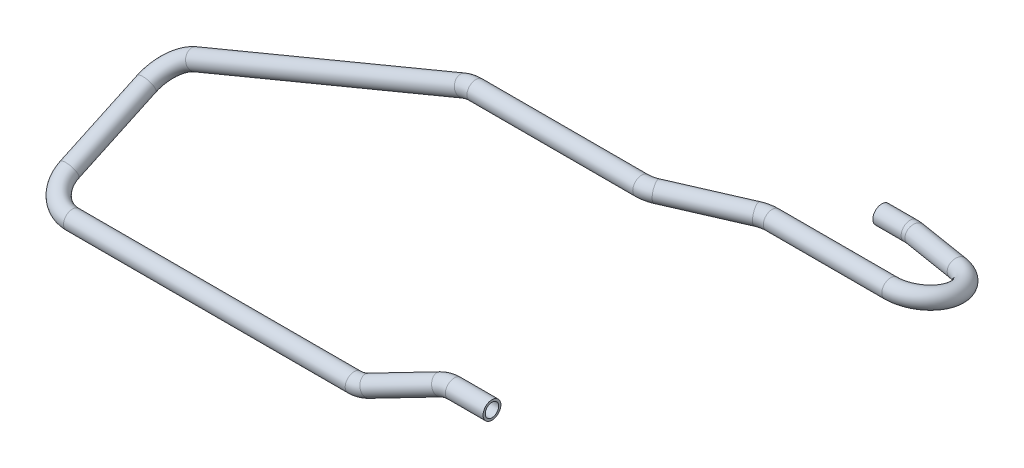
ISO-10303-21;
HEADER;
FILE_DESCRIPTION(('STEP AP214'),'2;1');
FILE_NAME('part.step','',(''),(''),'','','');
FILE_SCHEMA(('AUTOMOTIVE_DESIGN { 1 0 10303 214 1 1 1 1 }'));
ENDSEC;
DATA;
#1=APPLICATION_CONTEXT('core data for automotive mechanical design processes');
#2=APPLICATION_PROTOCOL_DEFINITION('international standard','automotive_design',2000,#1);
#3=PRODUCT_CONTEXT('',#1,'mechanical');
#4=PRODUCT('Part','Part','',(#3));
#5=PRODUCT_RELATED_PRODUCT_CATEGORY('part','',(#4));
#6=PRODUCT_DEFINITION_FORMATION('','',#4);
#7=PRODUCT_DEFINITION_CONTEXT('part definition',#1,'design');
#8=PRODUCT_DEFINITION('design','',#6,#7);
#9=PRODUCT_DEFINITION_SHAPE('','',#8);
#10=(LENGTH_UNIT() NAMED_UNIT(*) SI_UNIT(.MILLI.,.METRE.));
#11=(NAMED_UNIT(*) PLANE_ANGLE_UNIT() SI_UNIT($,.RADIAN.));
#12=(NAMED_UNIT(*) SI_UNIT($,.STERADIAN.) SOLID_ANGLE_UNIT());
#13=UNCERTAINTY_MEASURE_WITH_UNIT(LENGTH_MEASURE(1.E-05),#10,'distance_accuracy_value','');
#14=(GEOMETRIC_REPRESENTATION_CONTEXT(3) GLOBAL_UNCERTAINTY_ASSIGNED_CONTEXT((#13)) GLOBAL_UNIT_ASSIGNED_CONTEXT((#10,
#11,#12)) REPRESENTATION_CONTEXT('',''));
#15=CARTESIAN_POINT('',(0.,0.,0.));
#16=DIRECTION('',(0.,0.,1.));
#17=DIRECTION('',(1.,0.,0.));
#18=AXIS2_PLACEMENT_3D('',#15,#16,#17);
#19=CARTESIAN_POINT('',(130.018143321852,93.9997798299999,-151.));
#20=DIRECTION('',(-1.,0.,0.));
#21=DIRECTION('',(0.,0.,1.));
#22=AXIS2_PLACEMENT_3D('',#19,#20,#21);
#23=CYLINDRICAL_SURFACE('',#22,6.);
#24=CARTESIAN_POINT('',(130.018143321852,93.9997798299999,-151.));
#25=DIRECTION('',(-1.,0.,0.));
#26=DIRECTION('',(0.,0.999290144817172,0.0376723568585314));
#27=AXIS2_PLACEMENT_3D('',#24,#25,#26);
#28=CIRCLE('',#27,6.);
#29=CARTESIAN_POINT('',(130.018143321852,93.0133859061678,-156.918363542993));
#30=VERTEX_POINT('',#29);
#31=EDGE_CURVE('E47',#30,#30,#28,.T.);
#32=ORIENTED_EDGE('',*,*,#31,.T.);
#33=EDGE_LOOP('',(#32));
#34=FACE_BOUND('',#33,.T.);
#35=CARTESIAN_POINT('',(111.,93.9997798299999,-151.));
#36=DIRECTION('',(-1.,0.,0.));
#37=DIRECTION('',(0.,0.999290144817172,0.0376723568585314));
#38=AXIS2_PLACEMENT_3D('',#35,#36,#37);
#39=CIRCLE('',#38,6.);
#40=CARTESIAN_POINT('',(111.,99.995520698903,-150.773965858849));
#41=VERTEX_POINT('',#40);
#42=EDGE_CURVE('E10',#41,#41,#39,.T.);
#43=ORIENTED_EDGE('',*,*,#42,.F.);
#44=EDGE_LOOP('',(#43));
#45=FACE_BOUND('',#44,.T.);
#46=ADVANCED_FACE('F37',(#34,#45),#23,.T.);
#47=CARTESIAN_POINT('',(130.018143321852,93.9997798299999,-151.));
#48=DIRECTION('',(-1.,0.,0.));
#49=DIRECTION('',(0.,0.,1.));
#50=AXIS2_PLACEMENT_3D('',#47,#48,#49);
#51=CYLINDRICAL_SURFACE('',#50,4.5);
#52=CARTESIAN_POINT('',(130.018143321852,93.9997798299999,-151.));
#53=DIRECTION('',(-1.,0.,0.));
#54=DIRECTION('',(0.,0.999290144817172,0.0376723568585314));
#55=AXIS2_PLACEMENT_3D('',#52,#53,#54);
#56=CIRCLE('',#55,4.5);
#57=CARTESIAN_POINT('',(130.018143321852,93.2599843871258,-155.438772657245));
#58=VERTEX_POINT('',#57);
#59=EDGE_CURVE('E51',#58,#58,#56,.T.);
#60=ORIENTED_EDGE('',*,*,#59,.F.);
#61=EDGE_LOOP('',(#60));
#62=FACE_BOUND('',#61,.T.);
#63=CARTESIAN_POINT('',(111.,93.9997798299999,-151.));
#64=DIRECTION('',(-1.,0.,0.));
#65=DIRECTION('',(0.,0.999290144817172,0.0376723568585314));
#66=AXIS2_PLACEMENT_3D('',#63,#64,#65);
#67=CIRCLE('',#66,4.5);
#68=CARTESIAN_POINT('',(111.,98.4965854816772,-150.830474394137));
#69=VERTEX_POINT('',#68);
#70=EDGE_CURVE('E43',#69,#69,#67,.T.);
#71=ORIENTED_EDGE('',*,*,#70,.T.);
#72=EDGE_LOOP('',(#71));
#73=FACE_BOUND('',#72,.T.);
#74=ADVANCED_FACE('F287',(#62,#73),#51,.F.);
#75=CARTESIAN_POINT('',(130.018143321852,97.4521585634124,-130.285727599525));
#76=DIRECTION('',(0.,0.986393923832144,-0.164398987305357));
#77=DIRECTION('',(0.,0.164398987305357,0.986393923832144));
#78=AXIS2_PLACEMENT_3D('',#75,#76,#77);
#79=TOROIDAL_SURFACE('',#78,21.0000000000001,6.);
#80=CARTESIAN_POINT('',(133.946865607606,94.0607339994554,-150.634274983267));
#81=DIRECTION('',(-0.982344298189091,-0.0307560935800937,-0.184536561480577));
#82=DIRECTION('',(-0.037686188405205,0.998705443189747,0.0341641470939823));
#83=AXIS2_PLACEMENT_3D('',#80,#81,#82);
#84=CIRCLE('',#83,6.);
#85=CARTESIAN_POINT('',(135.06935768925,93.0917555526105,-156.448145664337));
#86=VERTEX_POINT('',#85);
#87=EDGE_CURVE('E56',#86,#86,#84,.T.);
#88=CARTESIAN_POINT('',(130.018143321852,97.4521585634124,-130.285727599525));
#89=DIRECTION('',(0.,0.986393923832144,-0.164398987305357));
#90=DIRECTION('',(0.,0.164398987305357,0.986393923832144));
#91=AXIS2_PLACEMENT_3D('',#88,#89,#90);
#92=CIRCLE('',#91,27.0000000000001);
#93=EDGE_CURVE('',#86,#30,#92,.T.);
#94=ORIENTED_EDGE('',*,*,#87,.T.);
#95=ORIENTED_EDGE('',*,*,#31,.F.);
#96=ORIENTED_EDGE('',*,*,#93,.T.);
#97=ORIENTED_EDGE('',*,*,#93,.F.);
#98=EDGE_LOOP('',(#94,#96,#95,#97));
#99=FACE_BOUND('',#98,.T.);
#100=ADVANCED_FACE('F283',(#99),#79,.T.);
#101=CARTESIAN_POINT('',(130.018143321852,97.4521585634124,-130.285727599525));
#102=DIRECTION('',(0.,0.986393923832144,-0.164398987305357));
#103=DIRECTION('',(0.,0.164398987305357,0.986393923832144));
#104=AXIS2_PLACEMENT_3D('',#101,#102,#103);
#105=TOROIDAL_SURFACE('',#104,21.0000000000001,4.5);
#106=CARTESIAN_POINT('',(133.946865607606,94.0607339994554,-150.634274983267));
#107=DIRECTION('',(-0.982344298189091,-0.0307560935800937,-0.184536561480577));
#108=DIRECTION('',(-0.037686188405205,0.998705443189747,0.0341641470939823));
#109=AXIS2_PLACEMENT_3D('',#106,#107,#108);
#110=CIRCLE('',#109,4.5);
#111=CARTESIAN_POINT('',(134.788734668839,93.3340001643217,-154.994677994069));
#112=VERTEX_POINT('',#111);
#113=EDGE_CURVE('E59',#112,#112,#110,.T.);
#114=CARTESIAN_POINT('',(130.018143321852,97.4521585634124,-130.285727599525));
#115=DIRECTION('',(0.,0.986393923832144,-0.164398987305357));
#116=DIRECTION('',(0.,0.164398987305357,0.986393923832144));
#117=AXIS2_PLACEMENT_3D('',#114,#115,#116);
#118=CIRCLE('',#117,25.5000000000001);
#119=EDGE_CURVE('',#112,#58,#118,.T.);
#120=ORIENTED_EDGE('',*,*,#113,.F.);
#121=ORIENTED_EDGE('',*,*,#59,.T.);
#122=ORIENTED_EDGE('',*,*,#119,.T.);
#123=ORIENTED_EDGE('',*,*,#119,.F.);
#124=EDGE_LOOP('',(#120,#122,#121,#123));
#125=FACE_BOUND('',#124,.T.);
#126=ADVANCED_FACE('F280',(#125),#105,.F.);
#127=CARTESIAN_POINT('',(168.928722285755,95.1559765326304,-144.062819784217));
#128=DIRECTION('',(-0.982344298189091,-0.0307560935800954,-0.184536561480576));
#129=DIRECTION('',(-0.184623903458137,0.,0.982809246126572));
#130=AXIS2_PLACEMENT_3D('',#127,#128,#129);
#131=CYLINDRICAL_SURFACE('',#130,6.);
#132=CARTESIAN_POINT('',(168.928722285755,95.1559765326304,-144.062819784217));
#133=DIRECTION('',(-0.982344298189091,-0.0307560935800937,-0.184536561480577));
#134=DIRECTION('',(-0.037686188405205,0.998705443189747,0.0341641470939823));
#135=AXIS2_PLACEMENT_3D('',#132,#133,#134);
#136=CIRCLE('',#135,6.);
#137=CARTESIAN_POINT('',(170.051214367399,94.1869980857855,-149.876690465287));
#138=VERTEX_POINT('',#137);
#139=EDGE_CURVE('E62',#138,#138,#136,.T.);
#140=ORIENTED_EDGE('',*,*,#139,.T.);
#141=EDGE_LOOP('',(#140));
#142=FACE_BOUND('',#141,.T.);
#143=ORIENTED_EDGE('',*,*,#87,.F.);
#144=EDGE_LOOP('',(#143));
#145=FACE_BOUND('',#144,.T.);
#146=ADVANCED_FACE('F276',(#142,#145),#131,.T.);
#147=CARTESIAN_POINT('',(168.928722285755,95.1559765326304,-144.062819784217));
#148=DIRECTION('',(-0.982344298189091,-0.0307560935800954,-0.184536561480576));
#149=DIRECTION('',(-0.184623903458137,0.,0.982809246126572));
#150=AXIS2_PLACEMENT_3D('',#147,#148,#149);
#151=CYLINDRICAL_SURFACE('',#150,4.5);
#152=CARTESIAN_POINT('',(168.928722285755,95.1559765326304,-144.062819784217));
#153=DIRECTION('',(-0.982344298189091,-0.0307560935800937,-0.184536561480577));
#154=DIRECTION('',(-0.037686188405205,0.998705443189747,0.0341641470939823));
#155=AXIS2_PLACEMENT_3D('',#152,#153,#154);
#156=CIRCLE('',#155,4.5);
#157=CARTESIAN_POINT('',(169.770591346988,94.4292426974967,-148.423222795019));
#158=VERTEX_POINT('',#157);
#159=EDGE_CURVE('E65',#158,#158,#156,.T.);
#160=ORIENTED_EDGE('',*,*,#159,.F.);
#161=EDGE_LOOP('',(#160));
#162=FACE_BOUND('',#161,.T.);
#163=ORIENTED_EDGE('',*,*,#113,.T.);
#164=EDGE_LOOP('',(#163));
#165=FACE_BOUND('',#164,.T.);
#166=ADVANCED_FACE('F273',(#162,#165),#151,.F.);
#167=CARTESIAN_POINT('',(165.,98.5474010965874,-123.714272400475));
#168=DIRECTION('',(0.,0.986393923832144,-0.164398987305357));
#169=DIRECTION('',(0.,0.164398987305357,0.986393923832144));
#170=AXIS2_PLACEMENT_3D('',#167,#168,#169);
#171=TOROIDAL_SURFACE('',#170,21.,6.);
#172=CARTESIAN_POINT('',(165.,101.99977983,-103.));
#173=DIRECTION('',(1.,0.,0.));
#174=DIRECTION('',(0.,0.933056399629692,-0.359730114266342));
#175=AXIS2_PLACEMENT_3D('',#172,#173,#174);
#176=CIRCLE('',#175,6.);
#177=CARTESIAN_POINT('',(165.,102.986173753832,-97.0816364570071));
#178=VERTEX_POINT('',#177);
#179=EDGE_CURVE('E68',#178,#178,#176,.T.);
#180=CARTESIAN_POINT('',(165.,98.5474010965874,-123.714272400475));
#181=DIRECTION('',(0.,0.986393923832144,-0.164398987305357));
#182=DIRECTION('',(0.,0.164398987305357,0.986393923832144));
#183=AXIS2_PLACEMENT_3D('',#180,#181,#182);
#184=CIRCLE('',#183,27.);
#185=EDGE_CURVE('',#178,#138,#184,.T.);
#186=ORIENTED_EDGE('',*,*,#179,.T.);
#187=ORIENTED_EDGE('',*,*,#139,.F.);
#188=ORIENTED_EDGE('',*,*,#185,.T.);
#189=ORIENTED_EDGE('',*,*,#185,.F.);
#190=EDGE_LOOP('',(#186,#188,#187,#189));
#191=FACE_BOUND('',#190,.T.);
#192=ADVANCED_FACE('F269',(#191),#171,.T.);
#193=CARTESIAN_POINT('',(165.,98.5474010965874,-123.714272400475));
#194=DIRECTION('',(0.,0.986393923832144,-0.164398987305357));
#195=DIRECTION('',(0.,0.164398987305357,0.986393923832144));
#196=AXIS2_PLACEMENT_3D('',#193,#194,#195);
#197=TOROIDAL_SURFACE('',#196,21.,4.5);
#198=CARTESIAN_POINT('',(165.,101.99977983,-103.));
#199=DIRECTION('',(1.,0.,0.));
#200=DIRECTION('',(0.,0.933056399629692,-0.359730114266342));
#201=AXIS2_PLACEMENT_3D('',#198,#199,#200);
#202=CIRCLE('',#201,4.5);
#203=CARTESIAN_POINT('',(165.,102.739575272874,-98.5612273427553));
#204=VERTEX_POINT('',#203);
#205=EDGE_CURVE('E71',#204,#204,#202,.T.);
#206=CARTESIAN_POINT('',(165.,98.5474010965874,-123.714272400475));
#207=DIRECTION('',(0.,0.986393923832144,-0.164398987305357));
#208=DIRECTION('',(0.,0.164398987305357,0.986393923832144));
#209=AXIS2_PLACEMENT_3D('',#206,#207,#208);
#210=CIRCLE('',#209,25.5);
#211=EDGE_CURVE('',#204,#158,#210,.T.);
#212=ORIENTED_EDGE('',*,*,#205,.F.);
#213=ORIENTED_EDGE('',*,*,#159,.T.);
#214=ORIENTED_EDGE('',*,*,#211,.T.);
#215=ORIENTED_EDGE('',*,*,#211,.F.);
#216=EDGE_LOOP('',(#212,#214,#213,#215));
#217=FACE_BOUND('',#216,.T.);
#218=ADVANCED_FACE('F266',(#217),#197,.F.);
#219=CARTESIAN_POINT('',(85.3822911603711,101.99977983,-103.));
#220=DIRECTION('',(1.,0.,0.));
#221=DIRECTION('',(0.,1.,0.));
#222=AXIS2_PLACEMENT_3D('',#219,#220,#221);
#223=CYLINDRICAL_SURFACE('',#222,6.);
#224=CARTESIAN_POINT('',(85.3822911603711,101.99977983,-103.));
#225=DIRECTION('',(1.,0.,0.));
#226=DIRECTION('',(0.,0.933056399629692,-0.359730114266342));
#227=AXIS2_PLACEMENT_3D('',#224,#225,#226);
#228=CIRCLE('',#227,6.);
#229=CARTESIAN_POINT('',(85.3822911603711,101.99977983,-109.));
#230=VERTEX_POINT('',#229);
#231=EDGE_CURVE('E74',#230,#230,#228,.T.);
#232=ORIENTED_EDGE('',*,*,#231,.T.);
#233=EDGE_LOOP('',(#232));
#234=FACE_BOUND('',#233,.T.);
#235=ORIENTED_EDGE('',*,*,#179,.F.);
#236=EDGE_LOOP('',(#235));
#237=FACE_BOUND('',#236,.T.);
#238=ADVANCED_FACE('F262',(#234,#237),#223,.T.);
#239=CARTESIAN_POINT('',(85.3822911603711,101.99977983,-103.));
#240=DIRECTION('',(1.,0.,0.));
#241=DIRECTION('',(0.,1.,0.));
#242=AXIS2_PLACEMENT_3D('',#239,#240,#241);
#243=CYLINDRICAL_SURFACE('',#242,4.5);
#244=CARTESIAN_POINT('',(85.3822911603711,101.99977983,-103.));
#245=DIRECTION('',(1.,0.,0.));
#246=DIRECTION('',(0.,0.933056399629692,-0.359730114266342));
#247=AXIS2_PLACEMENT_3D('',#244,#245,#246);
#248=CIRCLE('',#247,4.5);
#249=CARTESIAN_POINT('',(85.3822911603711,101.99977983,-107.5));
#250=VERTEX_POINT('',#249);
#251=EDGE_CURVE('E77',#250,#250,#248,.T.);
#252=ORIENTED_EDGE('',*,*,#251,.F.);
#253=EDGE_LOOP('',(#252));
#254=FACE_BOUND('',#253,.T.);
#255=ORIENTED_EDGE('',*,*,#205,.T.);
#256=EDGE_LOOP('',(#255));
#257=FACE_BOUND('',#256,.T.);
#258=ADVANCED_FACE('F259',(#254,#257),#243,.F.);
#259=CARTESIAN_POINT('',(85.3822911603712,101.99977983,-82.));
#260=DIRECTION('',(0.,-1.,0.));
#261=DIRECTION('',(0.,0.,-1.));
#262=AXIS2_PLACEMENT_3D('',#259,#260,#261);
#263=TOROIDAL_SURFACE('',#262,21.,6.);
#264=CARTESIAN_POINT('',(76.9834575840385,101.99977983,-101.247326945762));
#265=DIRECTION('',(0.916539378369634,0.,-0.399944456015839));
#266=DIRECTION('',(-0.14387206486277,0.933056399629692,-0.32970681531051));
#267=AXIS2_PLACEMENT_3D('',#264,#265,#266);
#268=CIRCLE('',#267,6.);
#269=CARTESIAN_POINT('',(74.5837908479435,101.99977983,-106.74656321598));
#270=VERTEX_POINT('',#269);
#271=EDGE_CURVE('E80',#270,#270,#268,.T.);
#272=CARTESIAN_POINT('',(85.3822911603712,101.99977983,-82.));
#273=DIRECTION('',(0.,-1.,0.));
#274=DIRECTION('',(0.,0.,-1.));
#275=AXIS2_PLACEMENT_3D('',#272,#273,#274);
#276=CIRCLE('',#275,27.);
#277=EDGE_CURVE('',#270,#230,#276,.T.);
#278=ORIENTED_EDGE('',*,*,#271,.T.);
#279=ORIENTED_EDGE('',*,*,#231,.F.);
#280=ORIENTED_EDGE('',*,*,#277,.T.);
#281=ORIENTED_EDGE('',*,*,#277,.F.);
#282=EDGE_LOOP('',(#278,#280,#279,#281));
#283=FACE_BOUND('',#282,.T.);
#284=ADVANCED_FACE('F255',(#283),#263,.T.);
#285=CARTESIAN_POINT('',(85.3822911603712,101.99977983,-82.));
#286=DIRECTION('',(0.,-1.,0.));
#287=DIRECTION('',(0.,0.,-1.));
#288=AXIS2_PLACEMENT_3D('',#285,#286,#287);
#289=TOROIDAL_SURFACE('',#288,21.,4.5);
#290=CARTESIAN_POINT('',(76.9834575840385,101.99977983,-101.247326945762));
#291=DIRECTION('',(0.916539378369634,0.,-0.399944456015839));
#292=DIRECTION('',(-0.14387206486277,0.933056399629692,-0.32970681531051));
#293=AXIS2_PLACEMENT_3D('',#290,#291,#292);
#294=CIRCLE('',#293,4.5);
#295=CARTESIAN_POINT('',(75.1837075319672,101.99977983,-105.371754148426));
#296=VERTEX_POINT('',#295);
#297=EDGE_CURVE('E83',#296,#296,#294,.T.);
#298=CARTESIAN_POINT('',(85.3822911603712,101.99977983,-82.));
#299=DIRECTION('',(0.,-1.,0.));
#300=DIRECTION('',(0.,0.,-1.));
#301=AXIS2_PLACEMENT_3D('',#298,#299,#300);
#302=CIRCLE('',#301,25.5);
#303=EDGE_CURVE('',#296,#250,#302,.T.);
#304=ORIENTED_EDGE('',*,*,#297,.F.);
#305=ORIENTED_EDGE('',*,*,#251,.T.);
#306=ORIENTED_EDGE('',*,*,#303,.T.);
#307=ORIENTED_EDGE('',*,*,#303,.F.);
#308=EDGE_LOOP('',(#304,#306,#305,#307));
#309=FACE_BOUND('',#308,.T.);
#310=ADVANCED_FACE('F252',(#309),#289,.F.);
#311=CARTESIAN_POINT('',(30.0165424159614,101.99977983,-80.7526730542376));
#312=DIRECTION('',(0.916539378369633,0.,-0.39994445601584));
#313=DIRECTION('',(-0.39994445601584,0.,-0.916539378369633));
#314=AXIS2_PLACEMENT_3D('',#311,#312,#313);
#315=CYLINDRICAL_SURFACE('',#314,6.);
#316=CARTESIAN_POINT('',(30.0165424159614,101.99977983,-80.7526730542376));
#317=DIRECTION('',(0.916539378369634,0.,-0.399944456015839));
#318=DIRECTION('',(-0.14387206486277,0.933056399629692,-0.32970681531051));
#319=AXIS2_PLACEMENT_3D('',#316,#317,#318);
#320=CIRCLE('',#319,6.);
#321=CARTESIAN_POINT('',(32.4162091520564,101.99977983,-75.2534367840198));
#322=VERTEX_POINT('',#321);
#323=EDGE_CURVE('E86',#322,#322,#320,.T.);
#324=ORIENTED_EDGE('',*,*,#323,.T.);
#325=EDGE_LOOP('',(#324));
#326=FACE_BOUND('',#325,.T.);
#327=ORIENTED_EDGE('',*,*,#271,.F.);
#328=EDGE_LOOP('',(#327));
#329=FACE_BOUND('',#328,.T.);
#330=ADVANCED_FACE('F248',(#326,#329),#315,.T.);
#331=CARTESIAN_POINT('',(30.0165424159614,101.99977983,-80.7526730542376));
#332=DIRECTION('',(0.916539378369633,0.,-0.39994445601584));
#333=DIRECTION('',(-0.39994445601584,0.,-0.916539378369633));
#334=AXIS2_PLACEMENT_3D('',#331,#332,#333);
#335=CYLINDRICAL_SURFACE('',#334,4.5);
#336=CARTESIAN_POINT('',(30.0165424159614,101.99977983,-80.7526730542376));
#337=DIRECTION('',(0.916539378369634,0.,-0.399944456015839));
#338=DIRECTION('',(-0.14387206486277,0.933056399629692,-0.32970681531051));
#339=AXIS2_PLACEMENT_3D('',#336,#337,#338);
#340=CIRCLE('',#339,4.5);
#341=CARTESIAN_POINT('',(31.8162924680326,101.99977983,-76.6282458515743));
#342=VERTEX_POINT('',#341);
#343=EDGE_CURVE('E89',#342,#342,#340,.T.);
#344=ORIENTED_EDGE('',*,*,#343,.F.);
#345=EDGE_LOOP('',(#344));
#346=FACE_BOUND('',#345,.T.);
#347=ORIENTED_EDGE('',*,*,#297,.T.);
#348=EDGE_LOOP('',(#347));
#349=FACE_BOUND('',#348,.T.);
#350=ADVANCED_FACE('F245',(#346,#349),#335,.F.);
#351=CARTESIAN_POINT('',(21.6177088396288,101.99977983,-100.));
#352=DIRECTION('',(0.,1.,0.));
#353=DIRECTION('',(-1.,0.,0.));
#354=AXIS2_PLACEMENT_3D('',#351,#352,#353);
#355=TOROIDAL_SURFACE('',#354,21.,6.);
#356=CARTESIAN_POINT('',(21.6177088396287,101.99977983,-79.));
#357=DIRECTION('',(1.,0.,0.));
#358=DIRECTION('',(0.,0.933056399629692,-0.359730114266342));
#359=AXIS2_PLACEMENT_3D('',#356,#357,#358);
#360=CIRCLE('',#359,6.);
#361=CARTESIAN_POINT('',(21.6177088396287,101.99977983,-73.));
#362=VERTEX_POINT('',#361);
#363=EDGE_CURVE('E92',#362,#362,#360,.T.);
#364=CARTESIAN_POINT('',(21.6177088396288,101.99977983,-100.));
#365=DIRECTION('',(0.,1.,0.));
#366=DIRECTION('',(-1.,0.,0.));
#367=AXIS2_PLACEMENT_3D('',#364,#365,#366);
#368=CIRCLE('',#367,27.);
#369=EDGE_CURVE('',#362,#322,#368,.T.);
#370=ORIENTED_EDGE('',*,*,#363,.T.);
#371=ORIENTED_EDGE('',*,*,#323,.F.);
#372=ORIENTED_EDGE('',*,*,#369,.T.);
#373=ORIENTED_EDGE('',*,*,#369,.F.);
#374=EDGE_LOOP('',(#370,#372,#371,#373));
#375=FACE_BOUND('',#374,.T.);
#376=ADVANCED_FACE('F241',(#375),#355,.T.);
#377=CARTESIAN_POINT('',(21.6177088396288,101.99977983,-100.));
#378=DIRECTION('',(0.,1.,0.));
#379=DIRECTION('',(-1.,0.,0.));
#380=AXIS2_PLACEMENT_3D('',#377,#378,#379);
#381=TOROIDAL_SURFACE('',#380,21.,4.5);
#382=CARTESIAN_POINT('',(21.6177088396287,101.99977983,-79.));
#383=DIRECTION('',(1.,0.,0.));
#384=DIRECTION('',(0.,0.933056399629692,-0.359730114266342));
#385=AXIS2_PLACEMENT_3D('',#382,#383,#384);
#386=CIRCLE('',#385,4.5);
#387=CARTESIAN_POINT('',(21.6177088396287,101.99977983,-74.5));
#388=VERTEX_POINT('',#387);
#389=EDGE_CURVE('E95',#388,#388,#386,.T.);
#390=CARTESIAN_POINT('',(21.6177088396288,101.99977983,-100.));
#391=DIRECTION('',(0.,1.,0.));
#392=DIRECTION('',(-1.,0.,0.));
#393=AXIS2_PLACEMENT_3D('',#390,#391,#392);
#394=CIRCLE('',#393,25.5);
#395=EDGE_CURVE('',#388,#342,#394,.T.);
#396=ORIENTED_EDGE('',*,*,#389,.F.);
#397=ORIENTED_EDGE('',*,*,#343,.T.);
#398=ORIENTED_EDGE('',*,*,#395,.T.);
#399=ORIENTED_EDGE('',*,*,#395,.F.);
#400=EDGE_LOOP('',(#396,#398,#397,#399));
#401=FACE_BOUND('',#400,.T.);
#402=ADVANCED_FACE('F238',(#401),#381,.F.);
#403=CARTESIAN_POINT('',(-89.8147727172371,101.99977983,-79.));
#404=DIRECTION('',(1.,0.,0.));
#405=DIRECTION('',(0.,0.,-1.));
#406=AXIS2_PLACEMENT_3D('',#403,#404,#405);
#407=CYLINDRICAL_SURFACE('',#406,6.);
#408=CARTESIAN_POINT('',(-89.8147727172371,101.99977983,-79.));
#409=DIRECTION('',(1.,0.,0.));
#410=DIRECTION('',(0.,0.933056399629692,-0.359730114266342));
#411=AXIS2_PLACEMENT_3D('',#408,#409,#410);
#412=CIRCLE('',#411,6.);
#413=CARTESIAN_POINT('',(-89.8147727172371,107.99977983,-79.));
#414=VERTEX_POINT('',#413);
#415=EDGE_CURVE('E98',#414,#414,#412,.T.);
#416=ORIENTED_EDGE('',*,*,#415,.T.);
#417=EDGE_LOOP('',(#416));
#418=FACE_BOUND('',#417,.T.);
#419=ORIENTED_EDGE('',*,*,#363,.F.);
#420=EDGE_LOOP('',(#419));
#421=FACE_BOUND('',#420,.T.);
#422=ADVANCED_FACE('F234',(#418,#421),#407,.T.);
#423=CARTESIAN_POINT('',(-89.8147727172371,101.99977983,-79.));
#424=DIRECTION('',(1.,0.,0.));
#425=DIRECTION('',(0.,0.,-1.));
#426=AXIS2_PLACEMENT_3D('',#423,#424,#425);
#427=CYLINDRICAL_SURFACE('',#426,4.5);
#428=CARTESIAN_POINT('',(-89.8147727172371,101.99977983,-79.));
#429=DIRECTION('',(1.,0.,0.));
#430=DIRECTION('',(0.,0.933056399629692,-0.359730114266342));
#431=AXIS2_PLACEMENT_3D('',#428,#429,#430);
#432=CIRCLE('',#431,4.5);
#433=CARTESIAN_POINT('',(-89.8147727172371,106.49977983,-79.));
#434=VERTEX_POINT('',#433);
#435=EDGE_CURVE('E101',#434,#434,#432,.T.);
#436=ORIENTED_EDGE('',*,*,#435,.F.);
#437=EDGE_LOOP('',(#436));
#438=FACE_BOUND('',#437,.T.);
#439=ORIENTED_EDGE('',*,*,#389,.T.);
#440=EDGE_LOOP('',(#439));
#441=FACE_BOUND('',#440,.T.);
#442=ADVANCED_FACE('F231',(#438,#441),#427,.F.);
#443=CARTESIAN_POINT('',(-89.814772717237,80.99977983,-79.));
#444=DIRECTION('',(0.,0.,-1.));
#445=DIRECTION('',(-1.,0.,0.));
#446=AXIS2_PLACEMENT_3D('',#443,#444,#445);
#447=TOROIDAL_SURFACE('',#446,20.9999999999999,6.);
#448=CARTESIAN_POINT('',(-97.8654611068936,100.395305511266,-79.));
#449=DIRECTION('',(0.923596461012666,0.383366113793172,0.));
#450=DIRECTION('',(-0.357702205875883,0.861767588623204,-0.359730114266342));
#451=AXIS2_PLACEMENT_3D('',#448,#449,#450);
#452=CIRCLE('',#451,6.);
#453=CARTESIAN_POINT('',(-100.165657789653,105.936884277342,-79.));
#454=VERTEX_POINT('',#453);
#455=EDGE_CURVE('E104',#454,#454,#452,.T.);
#456=CARTESIAN_POINT('',(-89.814772717237,80.99977983,-79.));
#457=DIRECTION('',(0.,0.,-1.));
#458=DIRECTION('',(-1.,0.,0.));
#459=AXIS2_PLACEMENT_3D('',#456,#457,#458);
#460=CIRCLE('',#459,26.9999999999999);
#461=EDGE_CURVE('',#454,#414,#460,.T.);
#462=ORIENTED_EDGE('',*,*,#455,.T.);
#463=ORIENTED_EDGE('',*,*,#415,.F.);
#464=ORIENTED_EDGE('',*,*,#461,.T.);
#465=ORIENTED_EDGE('',*,*,#461,.F.);
#466=EDGE_LOOP('',(#462,#464,#463,#465));
#467=FACE_BOUND('',#466,.T.);
#468=ADVANCED_FACE('F227',(#467),#447,.T.);
#469=CARTESIAN_POINT('',(-89.814772717237,80.99977983,-79.));
#470=DIRECTION('',(0.,0.,-1.));
#471=DIRECTION('',(-1.,0.,0.));
#472=AXIS2_PLACEMENT_3D('',#469,#470,#471);
#473=TOROIDAL_SURFACE('',#472,20.9999999999999,4.5);
#474=CARTESIAN_POINT('',(-97.8654611068936,100.395305511266,-79.));
#475=DIRECTION('',(0.923596461012666,0.383366113793172,0.));
#476=DIRECTION('',(-0.357702205875883,0.861767588623204,-0.359730114266342));
#477=AXIS2_PLACEMENT_3D('',#474,#475,#476);
#478=CIRCLE('',#477,4.5);
#479=CARTESIAN_POINT('',(-99.5906086189629,104.551489585823,-79.));
#480=VERTEX_POINT('',#479);
#481=EDGE_CURVE('E107',#480,#480,#478,.T.);
#482=CARTESIAN_POINT('',(-89.814772717237,80.99977983,-79.));
#483=DIRECTION('',(0.,0.,-1.));
#484=DIRECTION('',(-1.,0.,0.));
#485=AXIS2_PLACEMENT_3D('',#482,#483,#484);
#486=CIRCLE('',#485,25.4999999999999);
#487=EDGE_CURVE('',#480,#434,#486,.T.);
#488=ORIENTED_EDGE('',*,*,#481,.F.);
#489=ORIENTED_EDGE('',*,*,#435,.T.);
#490=ORIENTED_EDGE('',*,*,#487,.T.);
#491=ORIENTED_EDGE('',*,*,#487,.F.);
#492=EDGE_LOOP('',(#488,#490,#489,#491));
#493=FACE_BOUND('',#492,.T.);
#494=ADVANCED_FACE('F224',(#493),#473,.F.);
#495=CARTESIAN_POINT('',(-278.529276144879,25.4054288737773,-79.));
#496=DIRECTION('',(0.923596461012666,0.383366113793172,0.));
#497=DIRECTION('',(-0.383366113793172,0.923596461012666,0.));
#498=AXIS2_PLACEMENT_3D('',#495,#496,#497);
#499=CYLINDRICAL_SURFACE('',#498,6.);
#500=CARTESIAN_POINT('',(-278.529276144879,25.4054288737773,-79.));
#501=DIRECTION('',(0.923596461012666,0.383366113793172,0.));
#502=DIRECTION('',(-0.357702205875883,0.861767588623204,-0.359730114266342));
#503=AXIS2_PLACEMENT_3D('',#500,#501,#502);
#504=CIRCLE('',#503,6.);
#505=CARTESIAN_POINT('',(-279.439130095125,27.597427222748,-84.5106541378797));
#506=VERTEX_POINT('',#505);
#507=EDGE_CURVE('E110',#506,#506,#504,.T.);
#508=ORIENTED_EDGE('',*,*,#507,.T.);
#509=EDGE_LOOP('',(#508));
#510=FACE_BOUND('',#509,.T.);
#511=ORIENTED_EDGE('',*,*,#455,.F.);
#512=EDGE_LOOP('',(#511));
#513=FACE_BOUND('',#512,.T.);
#514=ADVANCED_FACE('F220',(#510,#513),#499,.T.);
#515=CARTESIAN_POINT('',(-278.529276144879,25.4054288737773,-79.));
#516=DIRECTION('',(0.923596461012666,0.383366113793172,0.));
#517=DIRECTION('',(-0.383366113793172,0.923596461012666,0.));
#518=AXIS2_PLACEMENT_3D('',#515,#516,#517);
#519=CYLINDRICAL_SURFACE('',#518,4.5);
#520=CARTESIAN_POINT('',(-278.529276144879,25.4054288737773,-79.));
#521=DIRECTION('',(0.923596461012666,0.383366113793172,0.));
#522=DIRECTION('',(-0.357702205875883,0.861767588623204,-0.359730114266342));
#523=AXIS2_PLACEMENT_3D('',#520,#521,#522);
#524=CIRCLE('',#523,4.5);
#525=CARTESIAN_POINT('',(-279.211666607564,27.0494276355054,-83.1329906034098));
#526=VERTEX_POINT('',#525);
#527=EDGE_CURVE('E113',#526,#526,#524,.T.);
#528=ORIENTED_EDGE('',*,*,#527,.F.);
#529=EDGE_LOOP('',(#528));
#530=FACE_BOUND('',#529,.T.);
#531=ORIENTED_EDGE('',*,*,#481,.T.);
#532=EDGE_LOOP('',(#531));
#533=FACE_BOUND('',#532,.T.);
#534=ADVANCED_FACE('F217',(#530,#533),#519,.F.);
#535=CARTESIAN_POINT('',(-275.344787319017,17.7334346523799,-59.712710517421));
#536=DIRECTION('',(0.352099676882867,-0.848270109935084,-0.395554848446712));
#537=DIRECTION('',(0.,0.422618261740699,-0.90630778703665));
#538=AXIS2_PLACEMENT_3D('',#535,#536,#537);
#539=TOROIDAL_SURFACE('',#538,21.,6.);
#540=CARTESIAN_POINT('',(-295.,11.0321103939673,-62.8375893388987));
#541=DIRECTION('',(0.,0.4226182617407,-0.906307787036649));
#542=DIRECTION('',(-0.906307787036649,0.38302222155949,0.178606195156731));
#543=AXIS2_PLACEMENT_3D('',#540,#541,#542);
#544=CIRCLE('',#543,6.);
#545=CARTESIAN_POINT('',(-300.615775051709,9.11744632013508,-63.7304118593209));
#546=VERTEX_POINT('',#545);
#547=EDGE_CURVE('E116',#546,#546,#544,.T.);
#548=CARTESIAN_POINT('',(-275.344787319017,17.7334346523799,-59.712710517421));
#549=DIRECTION('',(0.352099676882867,-0.848270109935084,-0.395554848446712));
#550=DIRECTION('',(0.,0.422618261740699,-0.90630778703665));
#551=AXIS2_PLACEMENT_3D('',#548,#549,#550);
#552=CIRCLE('',#551,27.);
#553=EDGE_CURVE('',#546,#506,#552,.T.);
#554=ORIENTED_EDGE('',*,*,#547,.T.);
#555=ORIENTED_EDGE('',*,*,#507,.F.);
#556=ORIENTED_EDGE('',*,*,#553,.T.);
#557=ORIENTED_EDGE('',*,*,#553,.F.);
#558=EDGE_LOOP('',(#554,#556,#555,#557));
#559=FACE_BOUND('',#558,.T.);
#560=ADVANCED_FACE('F213',(#559),#539,.T.);
#561=CARTESIAN_POINT('',(-275.344787319017,17.7334346523799,-59.712710517421));
#562=DIRECTION('',(0.352099676882867,-0.848270109935084,-0.395554848446712));
#563=DIRECTION('',(0.,0.422618261740699,-0.90630778703665));
#564=AXIS2_PLACEMENT_3D('',#561,#562,#563);
#565=TOROIDAL_SURFACE('',#564,21.,4.5);
#566=CARTESIAN_POINT('',(-295.,11.0321103939673,-62.8375893388987));
#567=DIRECTION('',(0.,0.4226182617407,-0.906307787036649));
#568=DIRECTION('',(-0.906307787036649,0.38302222155949,0.178606195156731));
#569=AXIS2_PLACEMENT_3D('',#566,#567,#568);
#570=CIRCLE('',#569,4.5);
#571=CARTESIAN_POINT('',(-299.211831288782,9.59611233859312,-63.5072062292153));
#572=VERTEX_POINT('',#571);
#573=EDGE_CURVE('E119',#572,#572,#570,.T.);
#574=CARTESIAN_POINT('',(-275.344787319017,17.7334346523799,-59.712710517421));
#575=DIRECTION('',(0.352099676882867,-0.848270109935084,-0.395554848446712));
#576=DIRECTION('',(0.,0.422618261740699,-0.90630778703665));
#577=AXIS2_PLACEMENT_3D('',#574,#575,#576);
#578=CIRCLE('',#577,25.5);
#579=EDGE_CURVE('',#572,#526,#578,.T.);
#580=ORIENTED_EDGE('',*,*,#573,.F.);
#581=ORIENTED_EDGE('',*,*,#527,.T.);
#582=ORIENTED_EDGE('',*,*,#579,.T.);
#583=ORIENTED_EDGE('',*,*,#579,.F.);
#584=EDGE_LOOP('',(#580,#582,#581,#583));
#585=FACE_BOUND('',#584,.T.);
#586=ADVANCED_FACE('F210',(#585),#565,.F.);
#587=CARTESIAN_POINT('',(-295.,-13.1250165034453,-11.0324635277696));
#588=DIRECTION('',(0.,0.422618261740698,-0.90630778703665));
#589=DIRECTION('',(0.,0.90630778703665,0.422618261740698));
#590=AXIS2_PLACEMENT_3D('',#587,#588,#589);
#591=CYLINDRICAL_SURFACE('',#590,6.);
#592=CARTESIAN_POINT('',(-295.,-13.1250165034453,-11.0324635277696));
#593=DIRECTION('',(0.,0.4226182617407,-0.906307787036649));
#594=DIRECTION('',(-0.906307787036649,0.38302222155949,0.178606195156731));
#595=AXIS2_PLACEMENT_3D('',#592,#593,#594);
#596=CIRCLE('',#595,6.);
#597=CARTESIAN_POINT('',(-301.,-13.1250165034453,-11.0324635277696));
#598=VERTEX_POINT('',#597);
#599=EDGE_CURVE('E122',#598,#598,#596,.T.);
#600=ORIENTED_EDGE('',*,*,#599,.T.);
#601=EDGE_LOOP('',(#600));
#602=FACE_BOUND('',#601,.T.);
#603=ORIENTED_EDGE('',*,*,#547,.F.);
#604=EDGE_LOOP('',(#603));
#605=FACE_BOUND('',#604,.T.);
#606=ADVANCED_FACE('F206',(#602,#605),#591,.T.);
#607=CARTESIAN_POINT('',(-295.,-13.1250165034453,-11.0324635277696));
#608=DIRECTION('',(0.,0.422618261740698,-0.90630778703665));
#609=DIRECTION('',(0.,0.90630778703665,0.422618261740698));
#610=AXIS2_PLACEMENT_3D('',#607,#608,#609);
#611=CYLINDRICAL_SURFACE('',#610,4.5);
#612=CARTESIAN_POINT('',(-295.,-13.1250165034453,-11.0324635277696));
#613=DIRECTION('',(0.,0.4226182617407,-0.906307787036649));
#614=DIRECTION('',(-0.906307787036649,0.38302222155949,0.178606195156731));
#615=AXIS2_PLACEMENT_3D('',#612,#613,#614);
#616=CIRCLE('',#615,4.5);
#617=CARTESIAN_POINT('',(-299.5,-13.1250165034453,-11.0324635277696));
#618=VERTEX_POINT('',#617);
#619=EDGE_CURVE('E125',#618,#618,#616,.T.);
#620=ORIENTED_EDGE('',*,*,#619,.F.);
#621=EDGE_LOOP('',(#620));
#622=FACE_BOUND('',#621,.T.);
#623=ORIENTED_EDGE('',*,*,#573,.T.);
#624=EDGE_LOOP('',(#623));
#625=FACE_BOUND('',#624,.T.);
#626=ADVANCED_FACE('F203',(#622,#625),#611,.F.);
#627=CARTESIAN_POINT('',(-274.,-13.1250165034453,-11.0324635277697));
#628=DIRECTION('',(0.,-0.90630778703665,-0.4226182617407));
#629=DIRECTION('',(0.,0.4226182617407,-0.90630778703665));
#630=AXIS2_PLACEMENT_3D('',#627,#628,#629);
#631=TOROIDAL_SURFACE('',#630,21.,6.);
#632=CARTESIAN_POINT('',(-274.,-22.,7.99999999999999));
#633=DIRECTION('',(-1.,0.,0.));
#634=DIRECTION('',(0.,0.,1.));
#635=AXIS2_PLACEMENT_3D('',#632,#633,#634);
#636=CIRCLE('',#635,6.);
#637=CARTESIAN_POINT('',(-274.,-24.5357095704442,13.4378467222199));
#638=VERTEX_POINT('',#637);
#639=EDGE_CURVE('E128',#638,#638,#636,.T.);
#640=CARTESIAN_POINT('',(-274.,-13.1250165034453,-11.0324635277697));
#641=DIRECTION('',(0.,-0.90630778703665,-0.4226182617407));
#642=DIRECTION('',(0.,0.4226182617407,-0.90630778703665));
#643=AXIS2_PLACEMENT_3D('',#640,#641,#642);
#644=CIRCLE('',#643,27.);
#645=EDGE_CURVE('',#638,#598,#644,.T.);
#646=ORIENTED_EDGE('',*,*,#639,.T.);
#647=ORIENTED_EDGE('',*,*,#599,.F.);
#648=ORIENTED_EDGE('',*,*,#645,.T.);
#649=ORIENTED_EDGE('',*,*,#645,.F.);
#650=EDGE_LOOP('',(#646,#648,#647,#649));
#651=FACE_BOUND('',#650,.T.);
#652=ADVANCED_FACE('F199',(#651),#631,.T.);
#653=CARTESIAN_POINT('',(-274.,-13.1250165034453,-11.0324635277697));
#654=DIRECTION('',(0.,-0.90630778703665,-0.4226182617407));
#655=DIRECTION('',(0.,0.4226182617407,-0.90630778703665));
#656=AXIS2_PLACEMENT_3D('',#653,#654,#655);
#657=TOROIDAL_SURFACE('',#656,21.,4.5);
#658=CARTESIAN_POINT('',(-274.,-22.,7.99999999999999));
#659=DIRECTION('',(-1.,0.,0.));
#660=DIRECTION('',(0.,0.,1.));
#661=AXIS2_PLACEMENT_3D('',#658,#659,#660);
#662=CIRCLE('',#661,4.5);
#663=CARTESIAN_POINT('',(-274.,-23.9017821778332,12.0783850416649));
#664=VERTEX_POINT('',#663);
#665=EDGE_CURVE('E131',#664,#664,#662,.T.);
#666=CARTESIAN_POINT('',(-274.,-13.1250165034453,-11.0324635277697));
#667=DIRECTION('',(0.,-0.90630778703665,-0.4226182617407));
#668=DIRECTION('',(0.,0.4226182617407,-0.90630778703665));
#669=AXIS2_PLACEMENT_3D('',#666,#667,#668);
#670=CIRCLE('',#669,25.5);
#671=EDGE_CURVE('',#664,#618,#670,.T.);
#672=ORIENTED_EDGE('',*,*,#665,.F.);
#673=ORIENTED_EDGE('',*,*,#619,.T.);
#674=ORIENTED_EDGE('',*,*,#671,.T.);
#675=ORIENTED_EDGE('',*,*,#671,.F.);
#676=EDGE_LOOP('',(#672,#674,#673,#675));
#677=FACE_BOUND('',#676,.T.);
#678=ADVANCED_FACE('F196',(#677),#657,.F.);
#679=CARTESIAN_POINT('',(-84.6725928536866,-22.,8.));
#680=DIRECTION('',(-1.,0.,0.));
#681=DIRECTION('',(0.,0.,1.));
#682=AXIS2_PLACEMENT_3D('',#679,#680,#681);
#683=CYLINDRICAL_SURFACE('',#682,6.);
#684=CARTESIAN_POINT('',(-84.6725928536866,-22.,8.));
#685=DIRECTION('',(-1.,0.,0.));
#686=DIRECTION('',(0.,0.,1.));
#687=AXIS2_PLACEMENT_3D('',#684,#685,#686);
#688=CIRCLE('',#687,6.);
#689=CARTESIAN_POINT('',(-84.6725928536866,-27.6387605409306,10.0504583785202));
#690=VERTEX_POINT('',#689);
#691=EDGE_CURVE('E134',#690,#690,#688,.T.);
#692=ORIENTED_EDGE('',*,*,#691,.T.);
#693=EDGE_LOOP('',(#692));
#694=FACE_BOUND('',#693,.T.);
#695=ORIENTED_EDGE('',*,*,#639,.F.);
#696=EDGE_LOOP('',(#695));
#697=FACE_BOUND('',#696,.T.);
#698=ADVANCED_FACE('F192',(#694,#697),#683,.T.);
#699=CARTESIAN_POINT('',(-84.6725928536866,-22.,8.));
#700=DIRECTION('',(-1.,0.,0.));
#701=DIRECTION('',(0.,0.,1.));
#702=AXIS2_PLACEMENT_3D('',#699,#700,#701);
#703=CYLINDRICAL_SURFACE('',#702,4.5);
#704=CARTESIAN_POINT('',(-84.6725928536866,-22.,8.));
#705=DIRECTION('',(-1.,0.,0.));
#706=DIRECTION('',(0.,0.,1.));
#707=AXIS2_PLACEMENT_3D('',#704,#705,#706);
#708=CIRCLE('',#707,4.5);
#709=CARTESIAN_POINT('',(-84.6725928536866,-26.229070405698,9.53784378389017));
#710=VERTEX_POINT('',#709);
#711=EDGE_CURVE('E137',#710,#710,#708,.T.);
#712=ORIENTED_EDGE('',*,*,#711,.F.);
#713=EDGE_LOOP('',(#712));
#714=FACE_BOUND('',#713,.T.);
#715=ORIENTED_EDGE('',*,*,#665,.T.);
#716=EDGE_LOOP('',(#715));
#717=FACE_BOUND('',#716,.T.);
#718=ADVANCED_FACE('F189',(#714,#717),#703,.F.);
#719=CARTESIAN_POINT('',(-84.6725928536866,-2.26433810674283,0.823395675179194));
#720=DIRECTION('',(0.,-0.341743063086705,-0.939793423488437));
#721=DIRECTION('',(0.,0.939793423488437,-0.341743063086705));
#722=AXIS2_PLACEMENT_3D('',#719,#720,#721);
#723=TOROIDAL_SURFACE('',#722,21.,6.);
#724=CARTESIAN_POINT('',(-75.7682455123705,-20.138028025443,7.32291928197928));
#725=DIRECTION('',(-0.905654445002773,-0.39848795580122,0.144904711200444));
#726=DIRECTION('',(0.144904711200444,0.0303007621888904,0.988981541022222));
#727=AXIS2_PLACEMENT_3D('',#724,#725,#726);
#728=CIRCLE('',#727,6.);
#729=CARTESIAN_POINT('',(-73.2241462719945,-25.2447965736431,9.1799260267793));
#730=VERTEX_POINT('',#729);
#731=EDGE_CURVE('E140',#730,#730,#728,.T.);
#732=CARTESIAN_POINT('',(-84.6725928536866,-2.26433810674283,0.823395675179194));
#733=DIRECTION('',(0.,-0.341743063086705,-0.939793423488437));
#734=DIRECTION('',(0.,0.939793423488437,-0.341743063086705));
#735=AXIS2_PLACEMENT_3D('',#732,#733,#734);
#736=CIRCLE('',#735,27.);
#737=EDGE_CURVE('',#730,#690,#736,.T.);
#738=ORIENTED_EDGE('',*,*,#731,.T.);
#739=ORIENTED_EDGE('',*,*,#691,.F.);
#740=ORIENTED_EDGE('',*,*,#737,.T.);
#741=ORIENTED_EDGE('',*,*,#737,.F.);
#742=EDGE_LOOP('',(#738,#740,#739,#741));
#743=FACE_BOUND('',#742,.T.);
#744=ADVANCED_FACE('F185',(#743),#723,.T.);
#745=CARTESIAN_POINT('',(-84.6725928536866,-2.26433810674283,0.823395675179194));
#746=DIRECTION('',(0.,-0.341743063086705,-0.939793423488437));
#747=DIRECTION('',(0.,0.939793423488437,-0.341743063086705));
#748=AXIS2_PLACEMENT_3D('',#745,#746,#747);
#749=TOROIDAL_SURFACE('',#748,21.,4.5);
#750=CARTESIAN_POINT('',(-75.7682455123705,-20.138028025443,7.32291928197928));
#751=DIRECTION('',(-0.905654445002773,-0.39848795580122,0.144904711200444));
#752=DIRECTION('',(0.144904711200444,0.0303007621888904,0.988981541022222));
#753=AXIS2_PLACEMENT_3D('',#750,#751,#752);
#754=CIRCLE('',#753,4.5);
#755=CARTESIAN_POINT('',(-73.8601710820885,-23.9681044365931,8.7156743405793));
#756=VERTEX_POINT('',#755);
#757=EDGE_CURVE('E143',#756,#756,#754,.T.);
#758=CARTESIAN_POINT('',(-84.6725928536866,-2.26433810674283,0.823395675179194));
#759=DIRECTION('',(0.,-0.341743063086705,-0.939793423488437));
#760=DIRECTION('',(0.,0.939793423488437,-0.341743063086705));
#761=AXIS2_PLACEMENT_3D('',#758,#759,#760);
#762=CIRCLE('',#761,25.5);
#763=EDGE_CURVE('',#756,#710,#762,.T.);
#764=ORIENTED_EDGE('',*,*,#757,.F.);
#765=ORIENTED_EDGE('',*,*,#711,.T.);
#766=ORIENTED_EDGE('',*,*,#763,.T.);
#767=ORIENTED_EDGE('',*,*,#763,.F.);
#768=EDGE_LOOP('',(#764,#766,#765,#767));
#769=FACE_BOUND('',#768,.T.);
#770=ADVANCED_FACE('F182',(#769),#749,.F.);
#771=CARTESIAN_POINT('',(-34.2317544876295,-1.86197197455697,0.677080718020717));
#772=DIRECTION('',(-0.905654445002773,-0.39848795580122,0.144904711200444));
#773=DIRECTION('',(0.402738614266017,-0.915315032422765,0.));
#774=AXIS2_PLACEMENT_3D('',#771,#772,#773);
#775=CYLINDRICAL_SURFACE('',#774,6.);
#776=CARTESIAN_POINT('',(-34.2317544876295,-1.86197197455697,0.677080718020717));
#777=DIRECTION('',(-0.905654445002773,-0.39848795580122,0.144904711200444));
#778=DIRECTION('',(0.144904711200444,0.0303007621888904,0.988981541022222));
#779=AXIS2_PLACEMENT_3D('',#776,#777,#778);
#780=CIRCLE('',#779,6.);
#781=CARTESIAN_POINT('',(-36.7758537280055,3.24479657364309,-1.17992602677931));
#782=VERTEX_POINT('',#781);
#783=EDGE_CURVE('E146',#782,#782,#780,.T.);
#784=ORIENTED_EDGE('',*,*,#783,.T.);
#785=EDGE_LOOP('',(#784));
#786=FACE_BOUND('',#785,.T.);
#787=ORIENTED_EDGE('',*,*,#731,.F.);
#788=EDGE_LOOP('',(#787));
#789=FACE_BOUND('',#788,.T.);
#790=ADVANCED_FACE('F178',(#786,#789),#775,.T.);
#791=CARTESIAN_POINT('',(-34.2317544876295,-1.86197197455697,0.677080718020717));
#792=DIRECTION('',(-0.905654445002773,-0.39848795580122,0.144904711200444));
#793=DIRECTION('',(0.402738614266017,-0.915315032422765,0.));
#794=AXIS2_PLACEMENT_3D('',#791,#792,#793);
#795=CYLINDRICAL_SURFACE('',#794,4.5);
#796=CARTESIAN_POINT('',(-34.2317544876295,-1.86197197455697,0.677080718020717));
#797=DIRECTION('',(-0.905654445002773,-0.39848795580122,0.144904711200444));
#798=DIRECTION('',(0.144904711200444,0.0303007621888904,0.988981541022222));
#799=AXIS2_PLACEMENT_3D('',#796,#797,#798);
#800=CIRCLE('',#799,4.5);
#801=CARTESIAN_POINT('',(-36.1398289179115,1.96810443659308,-0.715674340579301));
#802=VERTEX_POINT('',#801);
#803=EDGE_CURVE('E149',#802,#802,#800,.T.);
#804=ORIENTED_EDGE('',*,*,#803,.F.);
#805=EDGE_LOOP('',(#804));
#806=FACE_BOUND('',#805,.T.);
#807=ORIENTED_EDGE('',*,*,#757,.T.);
#808=EDGE_LOOP('',(#807));
#809=FACE_BOUND('',#808,.T.);
#810=ADVANCED_FACE('F175',(#806,#809),#795,.F.);
#811=CARTESIAN_POINT('',(-25.3274071463134,-19.7356618932572,7.17660432482079));
#812=DIRECTION('',(0.,0.341743063086704,0.939793423488437));
#813=DIRECTION('',(0.,-0.939793423488437,0.341743063086704));
#814=AXIS2_PLACEMENT_3D('',#811,#812,#813);
#815=TOROIDAL_SURFACE('',#814,21.,6.);
#816=CARTESIAN_POINT('',(-25.3274071463134,0.,0.));
#817=DIRECTION('',(-1.,0.,0.));
#818=DIRECTION('',(0.,0.,1.));
#819=AXIS2_PLACEMENT_3D('',#816,#817,#818);
#820=CIRCLE('',#819,6.);
#821=CARTESIAN_POINT('',(-25.3274071463134,5.63876054093062,-2.05045837852023));
#822=VERTEX_POINT('',#821);
#823=EDGE_CURVE('E152',#822,#822,#820,.T.);
#824=CARTESIAN_POINT('',(-25.3274071463134,-19.7356618932572,7.17660432482079));
#825=DIRECTION('',(0.,0.341743063086704,0.939793423488437));
#826=DIRECTION('',(0.,-0.939793423488437,0.341743063086704));
#827=AXIS2_PLACEMENT_3D('',#824,#825,#826);
#828=CIRCLE('',#827,27.);
#829=EDGE_CURVE('',#822,#782,#828,.T.);
#830=ORIENTED_EDGE('',*,*,#823,.T.);
#831=ORIENTED_EDGE('',*,*,#783,.F.);
#832=ORIENTED_EDGE('',*,*,#829,.T.);
#833=ORIENTED_EDGE('',*,*,#829,.F.);
#834=EDGE_LOOP('',(#830,#832,#831,#833));
#835=FACE_BOUND('',#834,.T.);
#836=ADVANCED_FACE('F171',(#835),#815,.T.);
#837=CARTESIAN_POINT('',(-25.3274071463134,-19.7356618932572,7.17660432482079));
#838=DIRECTION('',(0.,0.341743063086704,0.939793423488437));
#839=DIRECTION('',(0.,-0.939793423488437,0.341743063086704));
#840=AXIS2_PLACEMENT_3D('',#837,#838,#839);
#841=TOROIDAL_SURFACE('',#840,21.,4.5);
#842=CARTESIAN_POINT('',(-25.3274071463134,0.,0.));
#843=DIRECTION('',(-1.,0.,0.));
#844=DIRECTION('',(0.,0.,1.));
#845=AXIS2_PLACEMENT_3D('',#842,#843,#844);
#846=CIRCLE('',#845,4.5);
#847=CARTESIAN_POINT('',(-25.3274071463134,4.22907040569797,-1.53784378389017));
#848=VERTEX_POINT('',#847);
#849=EDGE_CURVE('E156',#848,#848,#846,.T.);
#850=CARTESIAN_POINT('',(-25.3274071463134,-19.7356618932572,7.17660432482079));
#851=DIRECTION('',(0.,0.341743063086704,0.939793423488437));
#852=DIRECTION('',(0.,-0.939793423488437,0.341743063086704));
#853=AXIS2_PLACEMENT_3D('',#850,#851,#852);
#854=CIRCLE('',#853,25.5);
#855=EDGE_CURVE('',#848,#802,#854,.T.);
#856=ORIENTED_EDGE('',*,*,#849,.F.);
#857=ORIENTED_EDGE('',*,*,#803,.T.);
#858=ORIENTED_EDGE('',*,*,#855,.T.);
#859=ORIENTED_EDGE('',*,*,#855,.F.);
#860=EDGE_LOOP('',(#856,#858,#857,#859));
#861=FACE_BOUND('',#860,.T.);
#862=ADVANCED_FACE('F168',(#861),#841,.F.);
#863=CARTESIAN_POINT('',(-25.3274071463134,0.,0.));
#864=DIRECTION('',(1.,0.,0.));
#865=DIRECTION('',(0.,0.,-1.));
#866=AXIS2_PLACEMENT_3D('',#863,#864,#865);
#867=CYLINDRICAL_SURFACE('',#866,4.5);
#868=ORIENTED_EDGE('',*,*,#849,.T.);
#869=EDGE_LOOP('',(#868));
#870=FACE_BOUND('',#869,.T.);
#871=CARTESIAN_POINT('',(0.,0.,0.));
#872=DIRECTION('',(-1.,0.,0.));
#873=DIRECTION('',(0.,0.,1.));
#874=AXIS2_PLACEMENT_3D('',#871,#872,#873);
#875=CIRCLE('',#874,4.5);
#876=CARTESIAN_POINT('',(0.,0.,4.5));
#877=VERTEX_POINT('',#876);
#878=EDGE_CURVE('E157',#877,#877,#875,.T.);
#879=ORIENTED_EDGE('',*,*,#878,.F.);
#880=EDGE_LOOP('',(#879));
#881=FACE_BOUND('',#880,.T.);
#882=ADVANCED_FACE('F165',(#870,#881),#867,.F.);
#883=CARTESIAN_POINT('',(-25.3274071463134,0.,0.));
#884=DIRECTION('',(1.,0.,0.));
#885=DIRECTION('',(0.,0.,-1.));
#886=AXIS2_PLACEMENT_3D('',#883,#884,#885);
#887=CYLINDRICAL_SURFACE('',#886,6.);
#888=ORIENTED_EDGE('',*,*,#823,.F.);
#889=EDGE_LOOP('',(#888));
#890=FACE_BOUND('',#889,.T.);
#891=CARTESIAN_POINT('',(0.,0.,0.));
#892=DIRECTION('',(-1.,0.,0.));
#893=DIRECTION('',(0.,0.,1.));
#894=AXIS2_PLACEMENT_3D('',#891,#892,#893);
#895=CIRCLE('',#894,6.);
#896=CARTESIAN_POINT('',(0.,0.,6.));
#897=VERTEX_POINT('',#896);
#898=EDGE_CURVE('E153',#897,#897,#895,.T.);
#899=ORIENTED_EDGE('',*,*,#898,.T.);
#900=EDGE_LOOP('',(#899));
#901=FACE_BOUND('',#900,.T.);
#902=ADVANCED_FACE('F347',(#890,#901),#887,.T.);
#903=CARTESIAN_POINT('',(111.,93.9997798299999,-151.));
#904=DIRECTION('',(-1.,0.,0.));
#905=DIRECTION('',(0.,0.999290144817172,0.0376723568585314));
#906=AXIS2_PLACEMENT_3D('',#903,#904,#905);
#907=PLANE('',#906);
#908=ORIENTED_EDGE('',*,*,#70,.F.);
#909=EDGE_LOOP('',(#908));
#910=FACE_BOUND('',#909,.T.);
#911=ORIENTED_EDGE('',*,*,#42,.T.);
#912=EDGE_LOOP('',(#911));
#913=FACE_BOUND('',#912,.T.);
#914=ADVANCED_FACE('F350',(#910,#913),#907,.T.);
#915=CARTESIAN_POINT('',(0.,0.,0.));
#916=DIRECTION('',(-1.,0.,0.));
#917=DIRECTION('',(0.,0.,1.));
#918=AXIS2_PLACEMENT_3D('',#915,#916,#917);
#919=PLANE('',#918);
#920=ORIENTED_EDGE('',*,*,#878,.T.);
#921=EDGE_LOOP('',(#920));
#922=FACE_BOUND('',#921,.T.);
#923=ORIENTED_EDGE('',*,*,#898,.F.);
#924=EDGE_LOOP('',(#923));
#925=FACE_BOUND('',#924,.T.);
#926=ADVANCED_FACE('F352',(#922,#925),#919,.F.);
#927=CLOSED_SHELL('',(#46,#74,#100,#126,#146,#166,#192,#218,#238,#258,#284,#310,#330,#350,#376,
#402,#422,#442,#468,#494,#514,#534,#560,#586,#606,#626,#652,#678,#698,#718,#744,#770,#790,#810,
#836,#862,#882,#902,#914,#926));
#928=MANIFOLD_SOLID_BREP('B2',#927);
#929=ADVANCED_BREP_SHAPE_REPRESENTATION('',(#18,#928),#14);
#930=SHAPE_DEFINITION_REPRESENTATION(#9,#929);
ENDSEC;
END-ISO-10303-21;
